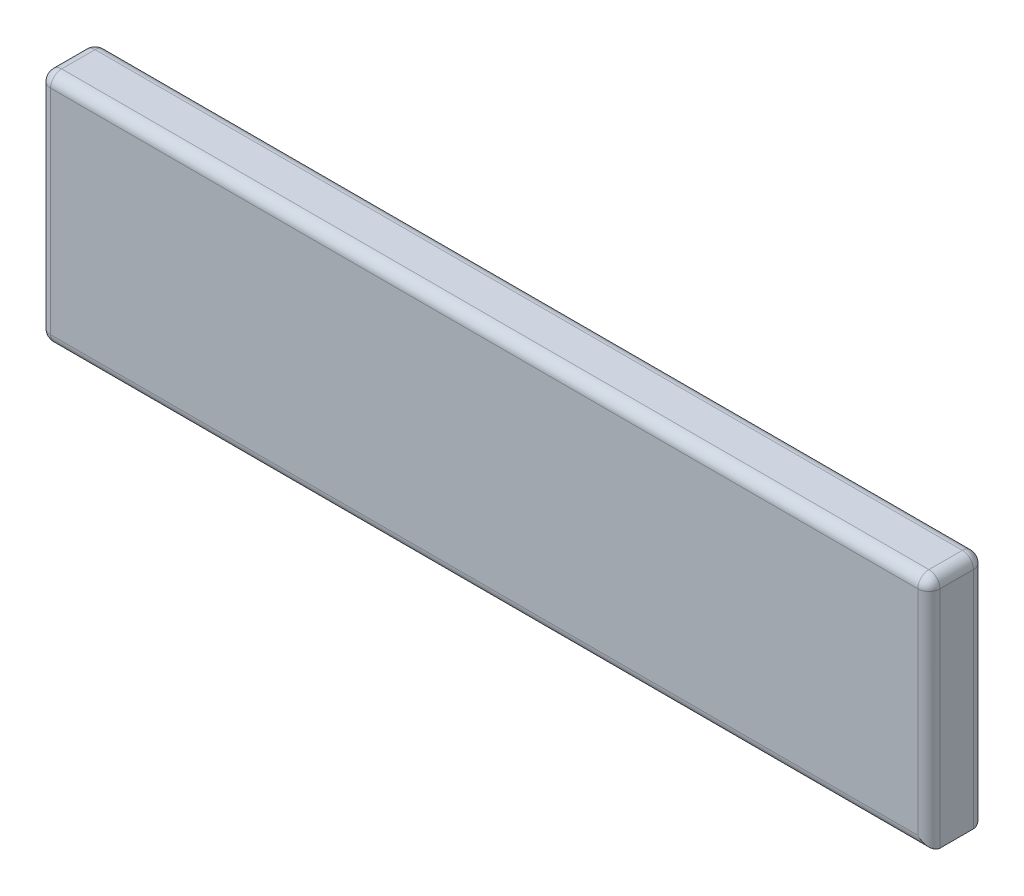
ISO-10303-21;
HEADER;
FILE_DESCRIPTION(('STEP AP214'),'2;1');
FILE_NAME('part.step','',(''),(''),'','','');
FILE_SCHEMA(('AUTOMOTIVE_DESIGN { 1 0 10303 214 1 1 1 1 }'));
ENDSEC;
DATA;
#1=APPLICATION_CONTEXT('core data for automotive mechanical design processes');
#2=APPLICATION_PROTOCOL_DEFINITION('international standard','automotive_design',2000,#1);
#3=PRODUCT_CONTEXT('',#1,'mechanical');
#4=PRODUCT('Part','Part','',(#3));
#5=PRODUCT_RELATED_PRODUCT_CATEGORY('part','',(#4));
#6=PRODUCT_DEFINITION_FORMATION('','',#4);
#7=PRODUCT_DEFINITION_CONTEXT('part definition',#1,'design');
#8=PRODUCT_DEFINITION('design','',#6,#7);
#9=PRODUCT_DEFINITION_SHAPE('','',#8);
#10=(LENGTH_UNIT() NAMED_UNIT(*) SI_UNIT(.MILLI.,.METRE.));
#11=(NAMED_UNIT(*) PLANE_ANGLE_UNIT() SI_UNIT($,.RADIAN.));
#12=(NAMED_UNIT(*) SI_UNIT($,.STERADIAN.) SOLID_ANGLE_UNIT());
#13=UNCERTAINTY_MEASURE_WITH_UNIT(LENGTH_MEASURE(1.E-05),#10,'distance_accuracy_value','');
#14=(GEOMETRIC_REPRESENTATION_CONTEXT(3) GLOBAL_UNCERTAINTY_ASSIGNED_CONTEXT((#13)) GLOBAL_UNIT_ASSIGNED_CONTEXT((#10,
#11,#12)) REPRESENTATION_CONTEXT('',''));
#15=CARTESIAN_POINT('',(0.,0.,0.));
#16=DIRECTION('',(0.,0.,1.));
#17=DIRECTION('',(1.,0.,0.));
#18=AXIS2_PLACEMENT_3D('',#15,#16,#17);
#19=CARTESIAN_POINT('',(-26.6964285714286,-2.4952380952381,2.5));
#20=DIRECTION('',(1.,0.,0.));
#21=DIRECTION('',(0.,0.,-1.));
#22=AXIS2_PLACEMENT_3D('',#19,#20,#21);
#23=PLANE('',#22);
#24=DIRECTION('',(0.,-1.,0.));
#25=VECTOR('',#24,1.);
#26=CARTESIAN_POINT('',(-26.6964285714286,-2.4952380952381,0.5));
#27=LINE('',#26,#25);
#28=CARTESIAN_POINT('',(-26.6964285714286,-2.9952380952381,0.5));
#29=VERTEX_POINT('',#28);
#30=CARTESIAN_POINT('',(-26.6964285714286,-12.5952380952381,0.5));
#31=VERTEX_POINT('',#30);
#32=EDGE_CURVE('E175',#29,#31,#27,.T.);
#33=ORIENTED_EDGE('',*,*,#32,.T.);
#34=DIRECTION('',(0.,0.,-1.));
#35=VECTOR('',#34,1.);
#36=CARTESIAN_POINT('',(-26.6964285714286,-12.5952380952381,2.5));
#37=LINE('',#36,#35);
#38=CARTESIAN_POINT('',(-26.6964285714286,-12.5952380952381,2.));
#39=VERTEX_POINT('',#38);
#40=EDGE_CURVE('E178',#31,#39,#37,.F.);
#41=ORIENTED_EDGE('',*,*,#40,.T.);
#42=DIRECTION('',(0.,-1.,0.));
#43=VECTOR('',#42,1.);
#44=CARTESIAN_POINT('',(-26.6964285714286,-2.4952380952381,2.));
#45=LINE('',#44,#43);
#46=CARTESIAN_POINT('',(-26.6964285714286,-2.9952380952381,2.));
#47=VERTEX_POINT('',#46);
#48=EDGE_CURVE('E172',#39,#47,#45,.F.);
#49=ORIENTED_EDGE('',*,*,#48,.T.);
#50=DIRECTION('',(0.,0.,-1.));
#51=VECTOR('',#50,1.);
#52=CARTESIAN_POINT('',(-26.6964285714286,-2.9952380952381,2.5));
#53=LINE('',#52,#51);
#54=EDGE_CURVE('E169',#47,#29,#53,.T.);
#55=ORIENTED_EDGE('',*,*,#54,.T.);
#56=EDGE_LOOP('',(#33,#41,#49,#55));
#57=FACE_BOUND('',#56,.T.);
#58=ADVANCED_FACE('F39',(#57),#23,.F.);
#59=CARTESIAN_POINT('',(-26.6964285714286,-13.0952380952381,2.5));
#60=DIRECTION('',(0.,1.,0.));
#61=DIRECTION('',(0.,0.,1.));
#62=AXIS2_PLACEMENT_3D('',#59,#60,#61);
#63=PLANE('',#62);
#64=DIRECTION('',(0.,0.,-1.));
#65=VECTOR('',#64,1.);
#66=CARTESIAN_POINT('',(-26.1964285714286,-13.0952380952381,2.5));
#67=LINE('',#66,#65);
#68=CARTESIAN_POINT('',(-26.1964285714286,-13.0952380952381,2.));
#69=VERTEX_POINT('',#68);
#70=CARTESIAN_POINT('',(-26.1964285714286,-13.0952380952381,0.5));
#71=VERTEX_POINT('',#70);
#72=EDGE_CURVE('E162',#69,#71,#67,.T.);
#73=ORIENTED_EDGE('',*,*,#72,.T.);
#74=DIRECTION('',(1.,0.,0.));
#75=VECTOR('',#74,1.);
#76=CARTESIAN_POINT('',(-26.6964285714286,-13.0952380952381,0.5));
#77=LINE('',#76,#75);
#78=CARTESIAN_POINT('',(13.3035714285714,-13.0952380952381,0.5));
#79=VERTEX_POINT('',#78);
#80=EDGE_CURVE('E142',#71,#79,#77,.T.);
#81=ORIENTED_EDGE('',*,*,#80,.T.);
#82=DIRECTION('',(0.,0.,-1.));
#83=VECTOR('',#82,1.);
#84=CARTESIAN_POINT('',(13.3035714285714,-13.0952380952381,2.5));
#85=LINE('',#84,#83);
#86=CARTESIAN_POINT('',(13.3035714285714,-13.0952380952381,2.));
#87=VERTEX_POINT('',#86);
#88=EDGE_CURVE('E125',#87,#79,#85,.T.);
#89=ORIENTED_EDGE('',*,*,#88,.F.);
#90=DIRECTION('',(1.,0.,0.));
#91=VECTOR('',#90,1.);
#92=CARTESIAN_POINT('',(-26.6964285714286,-13.0952380952381,2.));
#93=LINE('',#92,#91);
#94=EDGE_CURVE('E139',#87,#69,#93,.F.);
#95=ORIENTED_EDGE('',*,*,#94,.T.);
#96=EDGE_LOOP('',(#73,#81,#89,#95));
#97=FACE_BOUND('',#96,.T.);
#98=ADVANCED_FACE('F137',(#97),#63,.F.);
#99=CARTESIAN_POINT('',(13.3035714285714,-2.4952380952381,2.5));
#100=DIRECTION('',(-1.,0.,0.));
#101=DIRECTION('',(0.,-1.,0.));
#102=AXIS2_PLACEMENT_3D('',#99,#100,#101);
#103=PLANE('',#102);
#104=ORIENTED_EDGE('',*,*,#88,.T.);
#105=DIRECTION('',(0.,1.,0.));
#106=VECTOR('',#105,1.);
#107=CARTESIAN_POINT('',(13.3035714285714,-2.4952380952381,0.5));
#108=LINE('',#107,#106);
#109=CARTESIAN_POINT('',(13.3035714285714,-2.9952380952381,0.5));
#110=VERTEX_POINT('',#109);
#111=EDGE_CURVE('E133',#79,#110,#108,.T.);
#112=ORIENTED_EDGE('',*,*,#111,.T.);
#113=DIRECTION('',(0.,0.,-1.));
#114=VECTOR('',#113,1.);
#115=CARTESIAN_POINT('',(13.3035714285714,-2.9952380952381,2.5));
#116=LINE('',#115,#114);
#117=CARTESIAN_POINT('',(13.3035714285714,-2.9952380952381,2.));
#118=VERTEX_POINT('',#117);
#119=EDGE_CURVE('E128',#110,#118,#116,.F.);
#120=ORIENTED_EDGE('',*,*,#119,.T.);
#121=DIRECTION('',(0.,1.,0.));
#122=VECTOR('',#121,1.);
#123=CARTESIAN_POINT('',(13.3035714285714,-13.0952380952381,2.));
#124=LINE('',#123,#122);
#125=EDGE_CURVE('E122',#118,#87,#124,.F.);
#126=ORIENTED_EDGE('',*,*,#125,.T.);
#127=EDGE_LOOP('',(#104,#112,#120,#126));
#128=FACE_BOUND('',#127,.T.);
#129=ADVANCED_FACE('F124',(#128),#103,.F.);
#130=CARTESIAN_POINT('',(-26.6964285714286,-2.4952380952381,2.5));
#131=DIRECTION('',(0.,-1.,0.));
#132=DIRECTION('',(0.,0.,-1.));
#133=AXIS2_PLACEMENT_3D('',#130,#131,#132);
#134=PLANE('',#133);
#135=DIRECTION('',(-1.,0.,0.));
#136=VECTOR('',#135,1.);
#137=CARTESIAN_POINT('',(13.3035714285714,-2.4952380952381,2.));
#138=LINE('',#137,#136);
#139=CARTESIAN_POINT('',(-26.1964285714286,-2.4952380952381,2.));
#140=VERTEX_POINT('',#139);
#141=CARTESIAN_POINT('',(12.8035714285714,-2.4952380952381,2.));
#142=VERTEX_POINT('',#141);
#143=EDGE_CURVE('E49',#140,#142,#138,.F.);
#144=ORIENTED_EDGE('',*,*,#143,.T.);
#145=DIRECTION('',(0.,0.,-1.));
#146=VECTOR('',#145,1.);
#147=CARTESIAN_POINT('',(12.8035714285714,-2.4952380952381,2.5));
#148=LINE('',#147,#146);
#149=CARTESIAN_POINT('',(12.8035714285714,-2.4952380952381,0.5));
#150=VERTEX_POINT('',#149);
#151=EDGE_CURVE('E11',#142,#150,#148,.T.);
#152=ORIENTED_EDGE('',*,*,#151,.T.);
#153=DIRECTION('',(-1.,0.,0.));
#154=VECTOR('',#153,1.);
#155=CARTESIAN_POINT('',(-26.6964285714286,-2.4952380952381,0.5));
#156=LINE('',#155,#154);
#157=CARTESIAN_POINT('',(-26.1964285714286,-2.4952380952381,0.5));
#158=VERTEX_POINT('',#157);
#159=EDGE_CURVE('E210',#150,#158,#156,.T.);
#160=ORIENTED_EDGE('',*,*,#159,.T.);
#161=DIRECTION('',(0.,0.,-1.));
#162=VECTOR('',#161,1.);
#163=CARTESIAN_POINT('',(-26.1964285714286,-2.4952380952381,2.5));
#164=LINE('',#163,#162);
#165=EDGE_CURVE('E60',#158,#140,#164,.F.);
#166=ORIENTED_EDGE('',*,*,#165,.T.);
#167=EDGE_LOOP('',(#144,#152,#160,#166));
#168=FACE_BOUND('',#167,.T.);
#169=ADVANCED_FACE('F326',(#168),#134,.F.);
#170=CARTESIAN_POINT('',(0.,0.,2.5));
#171=DIRECTION('',(0.,0.,1.));
#172=DIRECTION('',(1.,0.,0.));
#173=AXIS2_PLACEMENT_3D('',#170,#171,#172);
#174=PLANE('',#173);
#175=DIRECTION('',(1.,0.,0.));
#176=VECTOR('',#175,1.);
#177=CARTESIAN_POINT('',(13.3035714285714,-12.5952380952381,2.5));
#178=LINE('',#177,#176);
#179=CARTESIAN_POINT('',(-26.1964285714286,-12.5952380952381,2.5));
#180=VERTEX_POINT('',#179);
#181=CARTESIAN_POINT('',(12.8035714285714,-12.5952380952381,2.5));
#182=VERTEX_POINT('',#181);
#183=EDGE_CURVE('E205',#180,#182,#178,.T.);
#184=ORIENTED_EDGE('',*,*,#183,.T.);
#185=DIRECTION('',(0.,1.,0.));
#186=VECTOR('',#185,1.);
#187=CARTESIAN_POINT('',(12.8035714285714,-2.4952380952381,2.5));
#188=LINE('',#187,#186);
#189=CARTESIAN_POINT('',(12.8035714285714,-2.9952380952381,2.5));
#190=VERTEX_POINT('',#189);
#191=EDGE_CURVE('E150',#182,#190,#188,.T.);
#192=ORIENTED_EDGE('',*,*,#191,.T.);
#193=DIRECTION('',(-1.,0.,0.));
#194=VECTOR('',#193,1.);
#195=CARTESIAN_POINT('',(-26.6964285714286,-2.9952380952381,2.5));
#196=LINE('',#195,#194);
#197=CARTESIAN_POINT('',(-26.1964285714286,-2.9952380952381,2.5));
#198=VERTEX_POINT('',#197);
#199=EDGE_CURVE('E199',#190,#198,#196,.T.);
#200=ORIENTED_EDGE('',*,*,#199,.T.);
#201=DIRECTION('',(0.,-1.,0.));
#202=VECTOR('',#201,1.);
#203=CARTESIAN_POINT('',(-26.1964285714286,-13.0952380952381,2.5));
#204=LINE('',#203,#202);
#205=EDGE_CURVE('E202',#198,#180,#204,.T.);
#206=ORIENTED_EDGE('',*,*,#205,.T.);
#207=EDGE_LOOP('',(#184,#192,#200,#206));
#208=FACE_BOUND('',#207,.T.);
#209=ADVANCED_FACE('F291',(#208),#174,.T.);
#210=CARTESIAN_POINT('',(0.,0.,0.));
#211=DIRECTION('',(0.,0.,1.));
#212=DIRECTION('',(1.,0.,0.));
#213=AXIS2_PLACEMENT_3D('',#210,#211,#212);
#214=PLANE('',#213);
#215=DIRECTION('',(0.,1.,0.));
#216=VECTOR('',#215,1.);
#217=CARTESIAN_POINT('',(12.8035714285714,0.,0.));
#218=LINE('',#217,#216);
#219=CARTESIAN_POINT('',(12.8035714285714,-2.9952380952381,0.));
#220=VERTEX_POINT('',#219);
#221=CARTESIAN_POINT('',(12.8035714285714,-12.5952380952381,0.));
#222=VERTEX_POINT('',#221);
#223=EDGE_CURVE('E188',#220,#222,#218,.F.);
#224=ORIENTED_EDGE('',*,*,#223,.T.);
#225=DIRECTION('',(1.,0.,0.));
#226=VECTOR('',#225,1.);
#227=CARTESIAN_POINT('',(0.,-12.5952380952381,0.));
#228=LINE('',#227,#226);
#229=CARTESIAN_POINT('',(-26.1964285714286,-12.5952380952381,0.));
#230=VERTEX_POINT('',#229);
#231=EDGE_CURVE('E191',#222,#230,#228,.F.);
#232=ORIENTED_EDGE('',*,*,#231,.T.);
#233=DIRECTION('',(0.,-1.,0.));
#234=VECTOR('',#233,1.);
#235=CARTESIAN_POINT('',(-26.1964285714286,0.,0.));
#236=LINE('',#235,#234);
#237=CARTESIAN_POINT('',(-26.1964285714286,-2.9952380952381,0.));
#238=VERTEX_POINT('',#237);
#239=EDGE_CURVE('E185',#230,#238,#236,.F.);
#240=ORIENTED_EDGE('',*,*,#239,.T.);
#241=DIRECTION('',(-1.,0.,0.));
#242=VECTOR('',#241,1.);
#243=CARTESIAN_POINT('',(0.,-2.9952380952381,0.));
#244=LINE('',#243,#242);
#245=EDGE_CURVE('E182',#238,#220,#244,.F.);
#246=ORIENTED_EDGE('',*,*,#245,.T.);
#247=EDGE_LOOP('',(#224,#232,#240,#246));
#248=FACE_BOUND('',#247,.T.);
#249=ADVANCED_FACE('F475',(#248),#214,.F.);
#250=CARTESIAN_POINT('',(12.8035714285714,-2.9952380952381,2.5));
#251=DIRECTION('',(0.,0.,-1.));
#252=DIRECTION('',(-1.,0.,0.));
#253=AXIS2_PLACEMENT_3D('',#250,#251,#252);
#254=CYLINDRICAL_SURFACE('',#253,0.5);
#255=CARTESIAN_POINT('',(12.8035714285714,-2.9952380952381,0.5));
#256=DIRECTION('',(0.,0.,-1.));
#257=DIRECTION('',(-1.,0.,0.));
#258=AXIS2_PLACEMENT_3D('',#255,#256,#257);
#259=CIRCLE('',#258,0.5);
#260=EDGE_CURVE('E273',#150,#110,#259,.T.);
#261=ORIENTED_EDGE('',*,*,#260,.F.);
#262=ORIENTED_EDGE('',*,*,#151,.F.);
#263=CARTESIAN_POINT('',(12.8035714285714,-2.9952380952381,2.));
#264=DIRECTION('',(0.,0.,1.));
#265=DIRECTION('',(1.,0.,0.));
#266=AXIS2_PLACEMENT_3D('',#263,#264,#265);
#267=CIRCLE('',#266,0.5);
#268=EDGE_CURVE('E276',#118,#142,#267,.T.);
#269=ORIENTED_EDGE('',*,*,#268,.F.);
#270=ORIENTED_EDGE('',*,*,#119,.F.);
#271=EDGE_LOOP('',(#261,#262,#269,#270));
#272=FACE_BOUND('',#271,.T.);
#273=ADVANCED_FACE('F41',(#272),#254,.T.);
#274=CARTESIAN_POINT('',(0.,-2.9952380952381,2.));
#275=DIRECTION('',(1.,0.,0.));
#276=DIRECTION('',(0.,0.,-1.));
#277=AXIS2_PLACEMENT_3D('',#274,#275,#276);
#278=CYLINDRICAL_SURFACE('',#277,0.5);
#279=CARTESIAN_POINT('',(12.8035714285714,-2.9952380952381,2.));
#280=DIRECTION('',(1.,0.,0.));
#281=DIRECTION('',(0.,0.,-1.));
#282=AXIS2_PLACEMENT_3D('',#279,#280,#281);
#283=CIRCLE('',#282,0.5);
#284=EDGE_CURVE('E43',#142,#190,#283,.T.);
#285=ORIENTED_EDGE('',*,*,#284,.F.);
#286=ORIENTED_EDGE('',*,*,#143,.F.);
#287=CARTESIAN_POINT('',(-26.1964285714286,-2.9952380952381,2.));
#288=DIRECTION('',(-1.,0.,0.));
#289=DIRECTION('',(0.,0.,1.));
#290=AXIS2_PLACEMENT_3D('',#287,#288,#289);
#291=CIRCLE('',#290,0.5);
#292=EDGE_CURVE('E261',#198,#140,#291,.T.);
#293=ORIENTED_EDGE('',*,*,#292,.F.);
#294=ORIENTED_EDGE('',*,*,#199,.F.);
#295=EDGE_LOOP('',(#285,#286,#293,#294));
#296=FACE_BOUND('',#295,.T.);
#297=ADVANCED_FACE('F288',(#296),#278,.T.);
#298=CARTESIAN_POINT('',(12.8035714285714,-2.9952380952381,2.));
#299=DIRECTION('',(0.,0.,1.));
#300=DIRECTION('',(1.,0.,0.));
#301=AXIS2_PLACEMENT_3D('',#298,#299,#300);
#302=SPHERICAL_SURFACE('',#301,0.5);
#303=ORIENTED_EDGE('',*,*,#268,.T.);
#304=ORIENTED_EDGE('',*,*,#284,.T.);
#305=CARTESIAN_POINT('',(12.8035714285714,-2.9952380952381,2.));
#306=DIRECTION('',(0.,1.,0.));
#307=DIRECTION('',(0.,0.,1.));
#308=AXIS2_PLACEMENT_3D('',#305,#306,#307);
#309=CIRCLE('',#308,0.5);
#310=EDGE_CURVE('E258',#118,#190,#309,.F.);
#311=ORIENTED_EDGE('',*,*,#310,.F.);
#312=EDGE_LOOP('',(#303,#304,#311));
#313=FACE_BOUND('',#312,.T.);
#314=ADVANCED_FACE('F285',(#313),#302,.T.);
#315=CARTESIAN_POINT('',(12.8035714285714,-2.9952380952381,0.5));
#316=DIRECTION('',(0.,0.,1.));
#317=DIRECTION('',(1.,0.,0.));
#318=AXIS2_PLACEMENT_3D('',#315,#316,#317);
#319=SPHERICAL_SURFACE('',#318,0.5);
#320=CARTESIAN_POINT('',(12.8035714285714,-2.9952380952381,0.5));
#321=DIRECTION('',(0.,1.,0.));
#322=DIRECTION('',(0.,0.,1.));
#323=AXIS2_PLACEMENT_3D('',#320,#321,#322);
#324=CIRCLE('',#323,0.5);
#325=EDGE_CURVE('E254',#220,#110,#324,.F.);
#326=ORIENTED_EDGE('',*,*,#325,.F.);
#327=CARTESIAN_POINT('',(12.8035714285714,-2.9952380952381,0.5));
#328=DIRECTION('',(1.,0.,0.));
#329=DIRECTION('',(0.,1.,0.));
#330=AXIS2_PLACEMENT_3D('',#327,#328,#329);
#331=CIRCLE('',#330,0.5);
#332=EDGE_CURVE('E269',#150,#220,#331,.F.);
#333=ORIENTED_EDGE('',*,*,#332,.F.);
#334=ORIENTED_EDGE('',*,*,#260,.T.);
#335=EDGE_LOOP('',(#326,#333,#334));
#336=FACE_BOUND('',#335,.T.);
#337=ADVANCED_FACE('F321',(#336),#319,.T.);
#338=CARTESIAN_POINT('',(-26.6964285714286,-2.9952380952381,0.5));
#339=DIRECTION('',(-1.,0.,0.));
#340=DIRECTION('',(0.,0.,1.));
#341=AXIS2_PLACEMENT_3D('',#338,#339,#340);
#342=CYLINDRICAL_SURFACE('',#341,0.5);
#343=ORIENTED_EDGE('',*,*,#332,.T.);
#344=ORIENTED_EDGE('',*,*,#245,.F.);
#345=CARTESIAN_POINT('',(-26.1964285714286,-2.9952380952381,0.5));
#346=DIRECTION('',(-1.,0.,0.));
#347=DIRECTION('',(0.,0.,1.));
#348=AXIS2_PLACEMENT_3D('',#345,#346,#347);
#349=CIRCLE('',#348,0.5);
#350=EDGE_CURVE('E250',#158,#238,#349,.T.);
#351=ORIENTED_EDGE('',*,*,#350,.F.);
#352=ORIENTED_EDGE('',*,*,#159,.F.);
#353=EDGE_LOOP('',(#343,#344,#351,#352));
#354=FACE_BOUND('',#353,.T.);
#355=ADVANCED_FACE('F324',(#354),#342,.T.);
#356=CARTESIAN_POINT('',(-26.1964285714286,-2.9952380952381,2.5));
#357=DIRECTION('',(0.,0.,-1.));
#358=DIRECTION('',(-1.,0.,0.));
#359=AXIS2_PLACEMENT_3D('',#356,#357,#358);
#360=CYLINDRICAL_SURFACE('',#359,0.5);
#361=CARTESIAN_POINT('',(-26.1964285714286,-2.9952380952381,2.));
#362=DIRECTION('',(0.,0.,1.));
#363=DIRECTION('',(1.,0.,0.));
#364=AXIS2_PLACEMENT_3D('',#361,#362,#363);
#365=CIRCLE('',#364,0.5);
#366=EDGE_CURVE('E265',#140,#47,#365,.T.);
#367=ORIENTED_EDGE('',*,*,#366,.F.);
#368=ORIENTED_EDGE('',*,*,#165,.F.);
#369=CARTESIAN_POINT('',(-26.1964285714286,-2.9952380952381,0.5));
#370=DIRECTION('',(0.,0.,-1.));
#371=DIRECTION('',(-1.,0.,0.));
#372=AXIS2_PLACEMENT_3D('',#369,#370,#371);
#373=CIRCLE('',#372,0.5);
#374=EDGE_CURVE('E246',#29,#158,#373,.T.);
#375=ORIENTED_EDGE('',*,*,#374,.F.);
#376=ORIENTED_EDGE('',*,*,#54,.F.);
#377=EDGE_LOOP('',(#367,#368,#375,#376));
#378=FACE_BOUND('',#377,.T.);
#379=ADVANCED_FACE('F330',(#378),#360,.T.);
#380=CARTESIAN_POINT('',(-26.1964285714286,-2.9952380952381,2.));
#381=DIRECTION('',(0.,0.,1.));
#382=DIRECTION('',(1.,0.,0.));
#383=AXIS2_PLACEMENT_3D('',#380,#381,#382);
#384=SPHERICAL_SURFACE('',#383,0.5);
#385=ORIENTED_EDGE('',*,*,#292,.T.);
#386=ORIENTED_EDGE('',*,*,#366,.T.);
#387=CARTESIAN_POINT('',(-26.1964285714286,-2.9952380952381,2.));
#388=DIRECTION('',(0.,1.,0.));
#389=DIRECTION('',(0.,0.,1.));
#390=AXIS2_PLACEMENT_3D('',#387,#388,#389);
#391=CIRCLE('',#390,0.5);
#392=EDGE_CURVE('E154',#198,#47,#391,.F.);
#393=ORIENTED_EDGE('',*,*,#392,.F.);
#394=EDGE_LOOP('',(#385,#386,#393));
#395=FACE_BOUND('',#394,.T.);
#396=ADVANCED_FACE('F334',(#395),#384,.T.);
#397=CARTESIAN_POINT('',(12.8035714285714,0.,2.));
#398=DIRECTION('',(0.,-1.,0.));
#399=DIRECTION('',(1.,0.,0.));
#400=AXIS2_PLACEMENT_3D('',#397,#398,#399);
#401=CYLINDRICAL_SURFACE('',#400,0.5);
#402=ORIENTED_EDGE('',*,*,#310,.T.);
#403=ORIENTED_EDGE('',*,*,#191,.F.);
#404=CARTESIAN_POINT('',(12.8035714285714,-12.5952380952381,2.));
#405=DIRECTION('',(-0.707106781186547,-0.707106781186548,0.));
#406=DIRECTION('',(-0.707106781186548,0.707106781186547,0.));
#407=AXIS2_PLACEMENT_3D('',#404,#405,#406);
#408=ELLIPSE('',#407,0.707106781186548,0.5);
#409=EDGE_CURVE('E147',#87,#182,#408,.T.);
#410=ORIENTED_EDGE('',*,*,#409,.F.);
#411=ORIENTED_EDGE('',*,*,#125,.F.);
#412=EDGE_LOOP('',(#402,#403,#410,#411));
#413=FACE_BOUND('',#412,.T.);
#414=ADVANCED_FACE('F148',(#413),#401,.T.);
#415=CARTESIAN_POINT('',(12.8035714285714,-2.4952380952381,0.5));
#416=DIRECTION('',(0.,1.,0.));
#417=DIRECTION('',(-1.,0.,0.));
#418=AXIS2_PLACEMENT_3D('',#415,#416,#417);
#419=CYLINDRICAL_SURFACE('',#418,0.5);
#420=ORIENTED_EDGE('',*,*,#325,.T.);
#421=ORIENTED_EDGE('',*,*,#111,.F.);
#422=CARTESIAN_POINT('',(12.8035714285714,-12.5952380952381,0.5));
#423=DIRECTION('',(0.707106781186547,0.707106781186548,0.));
#424=DIRECTION('',(-0.707106781186548,0.707106781186547,0.));
#425=AXIS2_PLACEMENT_3D('',#422,#423,#424);
#426=ELLIPSE('',#425,0.707106781186548,0.5);
#427=EDGE_CURVE('E155',#222,#79,#426,.F.);
#428=ORIENTED_EDGE('',*,*,#427,.F.);
#429=ORIENTED_EDGE('',*,*,#223,.F.);
#430=EDGE_LOOP('',(#420,#421,#428,#429));
#431=FACE_BOUND('',#430,.T.);
#432=ADVANCED_FACE('F315',(#431),#419,.T.);
#433=CARTESIAN_POINT('',(-26.1964285714286,-2.9952380952381,0.5));
#434=DIRECTION('',(0.,0.,1.));
#435=DIRECTION('',(1.,0.,0.));
#436=AXIS2_PLACEMENT_3D('',#433,#434,#435);
#437=SPHERICAL_SURFACE('',#436,0.5);
#438=ORIENTED_EDGE('',*,*,#374,.T.);
#439=ORIENTED_EDGE('',*,*,#350,.T.);
#440=CARTESIAN_POINT('',(-26.1964285714286,-2.9952380952381,0.5));
#441=DIRECTION('',(0.,1.,0.));
#442=DIRECTION('',(0.,0.,1.));
#443=AXIS2_PLACEMENT_3D('',#440,#441,#442);
#444=CIRCLE('',#443,0.5);
#445=EDGE_CURVE('E236',#29,#238,#444,.F.);
#446=ORIENTED_EDGE('',*,*,#445,.F.);
#447=EDGE_LOOP('',(#438,#439,#446));
#448=FACE_BOUND('',#447,.T.);
#449=ADVANCED_FACE('F368',(#448),#437,.T.);
#450=CARTESIAN_POINT('',(-26.1964285714286,0.,2.));
#451=DIRECTION('',(0.,1.,0.));
#452=DIRECTION('',(0.,0.,1.));
#453=AXIS2_PLACEMENT_3D('',#450,#451,#452);
#454=CYLINDRICAL_SURFACE('',#453,0.5);
#455=ORIENTED_EDGE('',*,*,#392,.T.);
#456=ORIENTED_EDGE('',*,*,#48,.F.);
#457=CARTESIAN_POINT('',(-26.1964285714286,-12.5952380952381,2.));
#458=DIRECTION('',(0.,-1.,0.));
#459=DIRECTION('',(0.,0.,-1.));
#460=AXIS2_PLACEMENT_3D('',#457,#458,#459);
#461=CIRCLE('',#460,0.5);
#462=EDGE_CURVE('E232',#180,#39,#461,.T.);
#463=ORIENTED_EDGE('',*,*,#462,.F.);
#464=ORIENTED_EDGE('',*,*,#205,.F.);
#465=EDGE_LOOP('',(#455,#456,#463,#464));
#466=FACE_BOUND('',#465,.T.);
#467=ADVANCED_FACE('F296',(#466),#454,.T.);
#468=CARTESIAN_POINT('',(0.,-12.5952380952381,2.));
#469=DIRECTION('',(-1.,0.,0.));
#470=DIRECTION('',(0.,0.,1.));
#471=AXIS2_PLACEMENT_3D('',#468,#469,#470);
#472=CYLINDRICAL_SURFACE('',#471,0.5);
#473=ORIENTED_EDGE('',*,*,#409,.T.);
#474=ORIENTED_EDGE('',*,*,#183,.F.);
#475=CARTESIAN_POINT('',(-26.1964285714286,-12.5952380952381,2.));
#476=DIRECTION('',(-1.,0.,0.));
#477=DIRECTION('',(0.,0.,1.));
#478=AXIS2_PLACEMENT_3D('',#475,#476,#477);
#479=CIRCLE('',#478,0.5);
#480=EDGE_CURVE('E159',#69,#180,#479,.T.);
#481=ORIENTED_EDGE('',*,*,#480,.F.);
#482=ORIENTED_EDGE('',*,*,#94,.F.);
#483=EDGE_LOOP('',(#473,#474,#481,#482));
#484=FACE_BOUND('',#483,.T.);
#485=ADVANCED_FACE('F157',(#484),#472,.T.);
#486=CARTESIAN_POINT('',(-26.6964285714286,-12.5952380952381,0.5));
#487=DIRECTION('',(1.,0.,0.));
#488=DIRECTION('',(0.,0.,-1.));
#489=AXIS2_PLACEMENT_3D('',#486,#487,#488);
#490=CYLINDRICAL_SURFACE('',#489,0.5);
#491=ORIENTED_EDGE('',*,*,#427,.T.);
#492=ORIENTED_EDGE('',*,*,#80,.F.);
#493=CARTESIAN_POINT('',(-26.1964285714286,-12.5952380952381,0.5));
#494=DIRECTION('',(-1.,0.,0.));
#495=DIRECTION('',(0.,0.,1.));
#496=AXIS2_PLACEMENT_3D('',#493,#494,#495);
#497=CIRCLE('',#496,0.5);
#498=EDGE_CURVE('E226',#230,#71,#497,.T.);
#499=ORIENTED_EDGE('',*,*,#498,.F.);
#500=ORIENTED_EDGE('',*,*,#231,.F.);
#501=EDGE_LOOP('',(#491,#492,#499,#500));
#502=FACE_BOUND('',#501,.T.);
#503=ADVANCED_FACE('F311',(#502),#490,.T.);
#504=CARTESIAN_POINT('',(-26.1964285714286,-2.4952380952381,0.5));
#505=DIRECTION('',(0.,-1.,0.));
#506=DIRECTION('',(0.,0.,-1.));
#507=AXIS2_PLACEMENT_3D('',#504,#505,#506);
#508=CYLINDRICAL_SURFACE('',#507,0.5);
#509=ORIENTED_EDGE('',*,*,#445,.T.);
#510=ORIENTED_EDGE('',*,*,#239,.F.);
#511=CARTESIAN_POINT('',(-26.1964285714286,-12.5952380952381,0.5));
#512=DIRECTION('',(0.,-1.,0.));
#513=DIRECTION('',(0.,0.,-1.));
#514=AXIS2_PLACEMENT_3D('',#511,#512,#513);
#515=CIRCLE('',#514,0.5);
#516=EDGE_CURVE('E223',#31,#230,#515,.T.);
#517=ORIENTED_EDGE('',*,*,#516,.F.);
#518=ORIENTED_EDGE('',*,*,#32,.F.);
#519=EDGE_LOOP('',(#509,#510,#517,#518));
#520=FACE_BOUND('',#519,.T.);
#521=ADVANCED_FACE('F358',(#520),#508,.T.);
#522=CARTESIAN_POINT('',(-26.1964285714286,-12.5952380952381,2.));
#523=DIRECTION('',(0.,0.,1.));
#524=DIRECTION('',(1.,0.,0.));
#525=AXIS2_PLACEMENT_3D('',#522,#523,#524);
#526=SPHERICAL_SURFACE('',#525,0.5);
#527=ORIENTED_EDGE('',*,*,#480,.T.);
#528=ORIENTED_EDGE('',*,*,#462,.T.);
#529=CARTESIAN_POINT('',(-26.1964285714286,-12.5952380952381,2.));
#530=DIRECTION('',(0.,0.,1.));
#531=DIRECTION('',(1.,0.,0.));
#532=AXIS2_PLACEMENT_3D('',#529,#530,#531);
#533=CIRCLE('',#532,0.5);
#534=EDGE_CURVE('E220',#69,#39,#533,.F.);
#535=ORIENTED_EDGE('',*,*,#534,.F.);
#536=EDGE_LOOP('',(#527,#528,#535));
#537=FACE_BOUND('',#536,.T.);
#538=ADVANCED_FACE('F298',(#537),#526,.T.);
#539=CARTESIAN_POINT('',(-26.1964285714286,-12.5952380952381,0.5));
#540=DIRECTION('',(0.,0.,1.));
#541=DIRECTION('',(1.,0.,0.));
#542=AXIS2_PLACEMENT_3D('',#539,#540,#541);
#543=SPHERICAL_SURFACE('',#542,0.5);
#544=ORIENTED_EDGE('',*,*,#516,.T.);
#545=ORIENTED_EDGE('',*,*,#498,.T.);
#546=CARTESIAN_POINT('',(-26.1964285714286,-12.5952380952381,0.5));
#547=DIRECTION('',(0.,0.,-1.));
#548=DIRECTION('',(-1.,0.,0.));
#549=AXIS2_PLACEMENT_3D('',#546,#547,#548);
#550=CIRCLE('',#549,0.5);
#551=EDGE_CURVE('E217',#31,#71,#550,.F.);
#552=ORIENTED_EDGE('',*,*,#551,.F.);
#553=EDGE_LOOP('',(#544,#545,#552));
#554=FACE_BOUND('',#553,.T.);
#555=ADVANCED_FACE('F306',(#554),#543,.T.);
#556=CARTESIAN_POINT('',(-26.1964285714286,-12.5952380952381,2.5));
#557=DIRECTION('',(0.,0.,-1.));
#558=DIRECTION('',(-1.,0.,0.));
#559=AXIS2_PLACEMENT_3D('',#556,#557,#558);
#560=CYLINDRICAL_SURFACE('',#559,0.5);
#561=ORIENTED_EDGE('',*,*,#534,.T.);
#562=ORIENTED_EDGE('',*,*,#40,.F.);
#563=ORIENTED_EDGE('',*,*,#551,.T.);
#564=ORIENTED_EDGE('',*,*,#72,.F.);
#565=EDGE_LOOP('',(#561,#562,#563,#564));
#566=FACE_BOUND('',#565,.T.);
#567=ADVANCED_FACE('F302',(#566),#560,.T.);
#568=CLOSED_SHELL('',(#58,#98,#129,#169,#209,#249,#273,#297,#314,#337,#355,#379,#396,#414,#432,
#449,#467,#485,#503,#521,#538,#555,#567));
#569=MANIFOLD_SOLID_BREP('B2',#568);
#570=ADVANCED_BREP_SHAPE_REPRESENTATION('',(#18,#569),#14);
#571=SHAPE_DEFINITION_REPRESENTATION(#9,#570);
ENDSEC;
END-ISO-10303-21;
